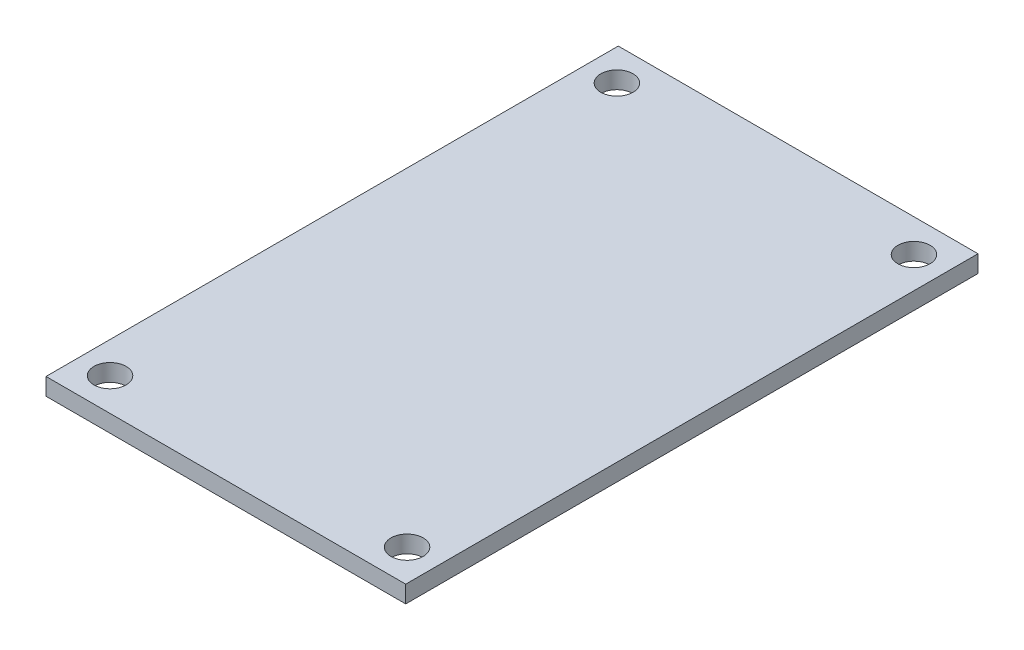
ISO-10303-21;
HEADER;
FILE_DESCRIPTION(('STEP AP214'),'2;1');
FILE_NAME('part.step','',(''),(''),'','','');
FILE_SCHEMA(('AUTOMOTIVE_DESIGN { 1 0 10303 214 1 1 1 1 }'));
ENDSEC;
DATA;
#1=APPLICATION_CONTEXT('core data for automotive mechanical design processes');
#2=APPLICATION_PROTOCOL_DEFINITION('international standard','automotive_design',2000,#1);
#3=PRODUCT_CONTEXT('',#1,'mechanical');
#4=PRODUCT('Part','Part','',(#3));
#5=PRODUCT_RELATED_PRODUCT_CATEGORY('part','',(#4));
#6=PRODUCT_DEFINITION_FORMATION('','',#4);
#7=PRODUCT_DEFINITION_CONTEXT('part definition',#1,'design');
#8=PRODUCT_DEFINITION('design','',#6,#7);
#9=PRODUCT_DEFINITION_SHAPE('','',#8);
#10=(LENGTH_UNIT() NAMED_UNIT(*) SI_UNIT(.MILLI.,.METRE.));
#11=(NAMED_UNIT(*) PLANE_ANGLE_UNIT() SI_UNIT($,.RADIAN.));
#12=(NAMED_UNIT(*) SI_UNIT($,.STERADIAN.) SOLID_ANGLE_UNIT());
#13=UNCERTAINTY_MEASURE_WITH_UNIT(LENGTH_MEASURE(1.E-05),#10,'distance_accuracy_value','');
#14=(GEOMETRIC_REPRESENTATION_CONTEXT(3) GLOBAL_UNCERTAINTY_ASSIGNED_CONTEXT((#13)) GLOBAL_UNIT_ASSIGNED_CONTEXT((#10,
#11,#12)) REPRESENTATION_CONTEXT('',''));
#15=CARTESIAN_POINT('',(0.,0.,0.));
#16=DIRECTION('',(0.,0.,1.));
#17=DIRECTION('',(1.,0.,0.));
#18=AXIS2_PLACEMENT_3D('',#15,#16,#17);
#19=CARTESIAN_POINT('',(0.,1.6,0.));
#20=DIRECTION('',(0.,1.,0.));
#21=DIRECTION('',(0.,0.,1.));
#22=AXIS2_PLACEMENT_3D('',#19,#20,#21);
#23=PLANE('',#22);
#24=CARTESIAN_POINT('',(13.8429999999998,1.6,23.6220000000001));
#25=DIRECTION('',(0.,1.,0.));
#26=DIRECTION('',(0.,0.,1.));
#27=AXIS2_PLACEMENT_3D('',#24,#25,#26);
#28=CIRCLE('',#27,1.5);
#29=CARTESIAN_POINT('',(13.8429999999998,1.6,25.1220000000001));
#30=VERTEX_POINT('',#29);
#31=EDGE_CURVE('E122',#30,#30,#28,.T.);
#32=ORIENTED_EDGE('',*,*,#31,.F.);
#33=EDGE_LOOP('',(#32));
#34=FACE_BOUND('',#33,.T.);
#35=CARTESIAN_POINT('',(-13.843,1.6,-23.622));
#36=DIRECTION('',(0.,1.,0.));
#37=DIRECTION('',(0.,0.,1.));
#38=AXIS2_PLACEMENT_3D('',#35,#36,#37);
#39=CIRCLE('',#38,1.5);
#40=CARTESIAN_POINT('',(-13.843,1.6,-22.122));
#41=VERTEX_POINT('',#40);
#42=EDGE_CURVE('E101',#41,#41,#39,.T.);
#43=ORIENTED_EDGE('',*,*,#42,.F.);
#44=EDGE_LOOP('',(#43));
#45=FACE_BOUND('',#44,.T.);
#46=DIRECTION('',(0.,0.,1.));
#47=VECTOR('',#46,1.);
#48=CARTESIAN_POINT('',(-16.764,1.6,26.67));
#49=LINE('',#48,#47);
#50=CARTESIAN_POINT('',(-16.764,1.6,-26.67));
#51=VERTEX_POINT('',#50);
#52=CARTESIAN_POINT('',(-16.764,1.6,26.67));
#53=VERTEX_POINT('',#52);
#54=EDGE_CURVE('E86',#51,#53,#49,.T.);
#55=ORIENTED_EDGE('',*,*,#54,.T.);
#56=DIRECTION('',(1.,0.,0.));
#57=VECTOR('',#56,1.);
#58=CARTESIAN_POINT('',(16.764,1.6,26.67));
#59=LINE('',#58,#57);
#60=CARTESIAN_POINT('',(16.764,1.6,26.67));
#61=VERTEX_POINT('',#60);
#62=EDGE_CURVE('E81',#53,#61,#59,.T.);
#63=ORIENTED_EDGE('',*,*,#62,.T.);
#64=DIRECTION('',(0.,0.,-1.));
#65=VECTOR('',#64,1.);
#66=CARTESIAN_POINT('',(16.764,1.6,26.67));
#67=LINE('',#66,#65);
#68=CARTESIAN_POINT('',(16.764,1.6,-26.67));
#69=VERTEX_POINT('',#68);
#70=EDGE_CURVE('E84',#61,#69,#67,.T.);
#71=ORIENTED_EDGE('',*,*,#70,.T.);
#72=DIRECTION('',(-1.,0.,0.));
#73=VECTOR('',#72,1.);
#74=CARTESIAN_POINT('',(16.764,1.6,-26.67));
#75=LINE('',#74,#73);
#76=EDGE_CURVE('E51',#69,#51,#75,.T.);
#77=ORIENTED_EDGE('',*,*,#76,.T.);
#78=EDGE_LOOP('',(#55,#63,#71,#77));
#79=FACE_BOUND('',#78,.T.);
#80=CARTESIAN_POINT('',(13.8429999999998,1.6,-23.6220000000001));
#81=DIRECTION('',(0.,1.,0.));
#82=DIRECTION('',(0.,0.,-1.));
#83=AXIS2_PLACEMENT_3D('',#80,#81,#82);
#84=CIRCLE('',#83,1.5);
#85=CARTESIAN_POINT('',(13.8429999999998,1.6,-25.1220000000001));
#86=VERTEX_POINT('',#85);
#87=EDGE_CURVE('E116',#86,#86,#84,.T.);
#88=ORIENTED_EDGE('',*,*,#87,.F.);
#89=EDGE_LOOP('',(#88));
#90=FACE_BOUND('',#89,.T.);
#91=CARTESIAN_POINT('',(-13.843,1.6,23.622));
#92=DIRECTION('',(0.,1.,0.));
#93=DIRECTION('',(0.,0.,-1.));
#94=AXIS2_PLACEMENT_3D('',#91,#92,#93);
#95=CIRCLE('',#94,1.5);
#96=CARTESIAN_POINT('',(-13.843,1.6,22.122));
#97=VERTEX_POINT('',#96);
#98=EDGE_CURVE('E128',#97,#97,#95,.T.);
#99=ORIENTED_EDGE('',*,*,#98,.F.);
#100=EDGE_LOOP('',(#99));
#101=FACE_BOUND('',#100,.T.);
#102=ADVANCED_FACE('F34',(#34,#45,#79,#90,#101),#23,.T.);
#103=CARTESIAN_POINT('',(0.,0.,0.));
#104=DIRECTION('',(0.,1.,0.));
#105=DIRECTION('',(0.,0.,1.));
#106=AXIS2_PLACEMENT_3D('',#103,#104,#105);
#107=PLANE('',#106);
#108=DIRECTION('',(0.,0.,1.));
#109=VECTOR('',#108,1.);
#110=CARTESIAN_POINT('',(-16.764,0.,26.67));
#111=LINE('',#110,#109);
#112=CARTESIAN_POINT('',(-16.764,0.,-26.67));
#113=VERTEX_POINT('',#112);
#114=CARTESIAN_POINT('',(-16.764,0.,26.67));
#115=VERTEX_POINT('',#114);
#116=EDGE_CURVE('E98',#113,#115,#111,.T.);
#117=ORIENTED_EDGE('',*,*,#116,.F.);
#118=DIRECTION('',(-1.,0.,0.));
#119=VECTOR('',#118,1.);
#120=CARTESIAN_POINT('',(16.764,0.,-26.67));
#121=LINE('',#120,#119);
#122=CARTESIAN_POINT('',(16.764,0.,-26.67));
#123=VERTEX_POINT('',#122);
#124=EDGE_CURVE('E74',#123,#113,#121,.T.);
#125=ORIENTED_EDGE('',*,*,#124,.F.);
#126=DIRECTION('',(0.,0.,-1.));
#127=VECTOR('',#126,1.);
#128=CARTESIAN_POINT('',(16.764,0.,26.67));
#129=LINE('',#128,#127);
#130=CARTESIAN_POINT('',(16.764,0.,26.67));
#131=VERTEX_POINT('',#130);
#132=EDGE_CURVE('E68',#131,#123,#129,.T.);
#133=ORIENTED_EDGE('',*,*,#132,.F.);
#134=DIRECTION('',(1.,0.,0.));
#135=VECTOR('',#134,1.);
#136=CARTESIAN_POINT('',(16.764,0.,26.67));
#137=LINE('',#136,#135);
#138=EDGE_CURVE('E90',#115,#131,#137,.T.);
#139=ORIENTED_EDGE('',*,*,#138,.F.);
#140=EDGE_LOOP('',(#117,#125,#133,#139));
#141=FACE_BOUND('',#140,.T.);
#142=CARTESIAN_POINT('',(-13.843,0.,-23.622));
#143=DIRECTION('',(0.,1.,0.));
#144=DIRECTION('',(0.,0.,1.));
#145=AXIS2_PLACEMENT_3D('',#142,#143,#144);
#146=CIRCLE('',#145,1.5);
#147=CARTESIAN_POINT('',(-13.843,0.,-22.122));
#148=VERTEX_POINT('',#147);
#149=EDGE_CURVE('E113',#148,#148,#146,.T.);
#150=ORIENTED_EDGE('',*,*,#149,.T.);
#151=EDGE_LOOP('',(#150));
#152=FACE_BOUND('',#151,.T.);
#153=CARTESIAN_POINT('',(13.8429999999998,0.,-23.6220000000001));
#154=DIRECTION('',(0.,1.,0.));
#155=DIRECTION('',(0.,0.,-1.));
#156=AXIS2_PLACEMENT_3D('',#153,#154,#155);
#157=CIRCLE('',#156,1.5);
#158=CARTESIAN_POINT('',(13.8429999999998,0.,-25.1220000000001));
#159=VERTEX_POINT('',#158);
#160=EDGE_CURVE('E119',#159,#159,#157,.T.);
#161=ORIENTED_EDGE('',*,*,#160,.T.);
#162=EDGE_LOOP('',(#161));
#163=FACE_BOUND('',#162,.T.);
#164=CARTESIAN_POINT('',(13.8429999999998,0.,23.6220000000001));
#165=DIRECTION('',(0.,1.,0.));
#166=DIRECTION('',(0.,0.,1.));
#167=AXIS2_PLACEMENT_3D('',#164,#165,#166);
#168=CIRCLE('',#167,1.5);
#169=CARTESIAN_POINT('',(13.8429999999998,0.,25.1220000000001));
#170=VERTEX_POINT('',#169);
#171=EDGE_CURVE('E125',#170,#170,#168,.T.);
#172=ORIENTED_EDGE('',*,*,#171,.T.);
#173=EDGE_LOOP('',(#172));
#174=FACE_BOUND('',#173,.T.);
#175=CARTESIAN_POINT('',(-13.843,0.,23.622));
#176=DIRECTION('',(0.,1.,0.));
#177=DIRECTION('',(0.,0.,-1.));
#178=AXIS2_PLACEMENT_3D('',#175,#176,#177);
#179=CIRCLE('',#178,1.5);
#180=CARTESIAN_POINT('',(-13.843,0.,22.122));
#181=VERTEX_POINT('',#180);
#182=EDGE_CURVE('E131',#181,#181,#179,.T.);
#183=ORIENTED_EDGE('',*,*,#182,.T.);
#184=EDGE_LOOP('',(#183));
#185=FACE_BOUND('',#184,.T.);
#186=ADVANCED_FACE('F109',(#141,#152,#163,#174,#185),#107,.F.);
#187=CARTESIAN_POINT('',(-16.764,1.6,26.67));
#188=DIRECTION('',(1.,0.,0.));
#189=DIRECTION('',(0.,0.,-1.));
#190=AXIS2_PLACEMENT_3D('',#187,#188,#189);
#191=PLANE('',#190);
#192=ORIENTED_EDGE('',*,*,#116,.T.);
#193=DIRECTION('',(0.,-1.,0.));
#194=VECTOR('',#193,1.);
#195=CARTESIAN_POINT('',(-16.764,1.6,26.67));
#196=LINE('',#195,#194);
#197=EDGE_CURVE('E11',#53,#115,#196,.T.);
#198=ORIENTED_EDGE('',*,*,#197,.F.);
#199=ORIENTED_EDGE('',*,*,#54,.F.);
#200=DIRECTION('',(0.,-1.,0.));
#201=VECTOR('',#200,1.);
#202=CARTESIAN_POINT('',(-16.764,1.6,-26.67));
#203=LINE('',#202,#201);
#204=EDGE_CURVE('E94',#51,#113,#203,.T.);
#205=ORIENTED_EDGE('',*,*,#204,.T.);
#206=EDGE_LOOP('',(#192,#198,#199,#205));
#207=FACE_BOUND('',#206,.T.);
#208=ADVANCED_FACE('F36',(#207),#191,.F.);
#209=CARTESIAN_POINT('',(16.764,1.6,26.67));
#210=DIRECTION('',(0.,0.,-1.));
#211=DIRECTION('',(-1.,0.,0.));
#212=AXIS2_PLACEMENT_3D('',#209,#210,#211);
#213=PLANE('',#212);
#214=ORIENTED_EDGE('',*,*,#138,.T.);
#215=DIRECTION('',(0.,-1.,0.));
#216=VECTOR('',#215,1.);
#217=CARTESIAN_POINT('',(16.764,1.6,26.67));
#218=LINE('',#217,#216);
#219=EDGE_CURVE('E43',#61,#131,#218,.T.);
#220=ORIENTED_EDGE('',*,*,#219,.F.);
#221=ORIENTED_EDGE('',*,*,#62,.F.);
#222=ORIENTED_EDGE('',*,*,#197,.T.);
#223=EDGE_LOOP('',(#214,#220,#221,#222));
#224=FACE_BOUND('',#223,.T.);
#225=ADVANCED_FACE('F89',(#224),#213,.F.);
#226=CARTESIAN_POINT('',(16.764,1.6,26.67));
#227=DIRECTION('',(-1.,0.,0.));
#228=DIRECTION('',(0.,0.,1.));
#229=AXIS2_PLACEMENT_3D('',#226,#227,#228);
#230=PLANE('',#229);
#231=ORIENTED_EDGE('',*,*,#132,.T.);
#232=DIRECTION('',(0.,-1.,0.));
#233=VECTOR('',#232,1.);
#234=CARTESIAN_POINT('',(16.764,1.6,-26.67));
#235=LINE('',#234,#233);
#236=EDGE_CURVE('E91',#69,#123,#235,.T.);
#237=ORIENTED_EDGE('',*,*,#236,.F.);
#238=ORIENTED_EDGE('',*,*,#70,.F.);
#239=ORIENTED_EDGE('',*,*,#219,.T.);
#240=EDGE_LOOP('',(#231,#237,#238,#239));
#241=FACE_BOUND('',#240,.T.);
#242=ADVANCED_FACE('F92',(#241),#230,.F.);
#243=CARTESIAN_POINT('',(16.764,1.6,-26.67));
#244=DIRECTION('',(0.,0.,1.));
#245=DIRECTION('',(1.,0.,0.));
#246=AXIS2_PLACEMENT_3D('',#243,#244,#245);
#247=PLANE('',#246);
#248=ORIENTED_EDGE('',*,*,#124,.T.);
#249=ORIENTED_EDGE('',*,*,#204,.F.);
#250=ORIENTED_EDGE('',*,*,#76,.F.);
#251=ORIENTED_EDGE('',*,*,#236,.T.);
#252=EDGE_LOOP('',(#248,#249,#250,#251));
#253=FACE_BOUND('',#252,.T.);
#254=ADVANCED_FACE('F106',(#253),#247,.F.);
#255=CARTESIAN_POINT('',(-13.843,1.6,-23.622));
#256=DIRECTION('',(0.,-1.,0.));
#257=DIRECTION('',(0.,0.,-1.));
#258=AXIS2_PLACEMENT_3D('',#255,#256,#257);
#259=CYLINDRICAL_SURFACE('',#258,1.5);
#260=ORIENTED_EDGE('',*,*,#42,.T.);
#261=EDGE_LOOP('',(#260));
#262=FACE_BOUND('',#261,.T.);
#263=ORIENTED_EDGE('',*,*,#149,.F.);
#264=EDGE_LOOP('',(#263));
#265=FACE_BOUND('',#264,.T.);
#266=ADVANCED_FACE('F150',(#262,#265),#259,.F.);
#267=CARTESIAN_POINT('',(13.8429999999998,1.6,-23.6220000000001));
#268=DIRECTION('',(0.,-1.,0.));
#269=DIRECTION('',(0.,0.,-1.));
#270=AXIS2_PLACEMENT_3D('',#267,#268,#269);
#271=CYLINDRICAL_SURFACE('',#270,1.5);
#272=ORIENTED_EDGE('',*,*,#87,.T.);
#273=EDGE_LOOP('',(#272));
#274=FACE_BOUND('',#273,.T.);
#275=ORIENTED_EDGE('',*,*,#160,.F.);
#276=EDGE_LOOP('',(#275));
#277=FACE_BOUND('',#276,.T.);
#278=ADVANCED_FACE('F196',(#274,#277),#271,.F.);
#279=CARTESIAN_POINT('',(13.8429999999998,1.6,23.6220000000001));
#280=DIRECTION('',(0.,-1.,0.));
#281=DIRECTION('',(0.,0.,-1.));
#282=AXIS2_PLACEMENT_3D('',#279,#280,#281);
#283=CYLINDRICAL_SURFACE('',#282,1.5);
#284=ORIENTED_EDGE('',*,*,#31,.T.);
#285=EDGE_LOOP('',(#284));
#286=FACE_BOUND('',#285,.T.);
#287=ORIENTED_EDGE('',*,*,#171,.F.);
#288=EDGE_LOOP('',(#287));
#289=FACE_BOUND('',#288,.T.);
#290=ADVANCED_FACE('F204',(#286,#289),#283,.F.);
#291=CARTESIAN_POINT('',(-13.843,1.6,23.622));
#292=DIRECTION('',(0.,-1.,0.));
#293=DIRECTION('',(0.,0.,-1.));
#294=AXIS2_PLACEMENT_3D('',#291,#292,#293);
#295=CYLINDRICAL_SURFACE('',#294,1.5);
#296=ORIENTED_EDGE('',*,*,#98,.T.);
#297=EDGE_LOOP('',(#296));
#298=FACE_BOUND('',#297,.T.);
#299=ORIENTED_EDGE('',*,*,#182,.F.);
#300=EDGE_LOOP('',(#299));
#301=FACE_BOUND('',#300,.T.);
#302=ADVANCED_FACE('F137',(#298,#301),#295,.F.);
#303=CLOSED_SHELL('',(#102,#186,#208,#225,#242,#254,#266,#278,#290,#302));
#304=MANIFOLD_SOLID_BREP('B2',#303);
#305=ADVANCED_BREP_SHAPE_REPRESENTATION('',(#18,#304),#14);
#306=SHAPE_DEFINITION_REPRESENTATION(#9,#305);
ENDSEC;
END-ISO-10303-21;
